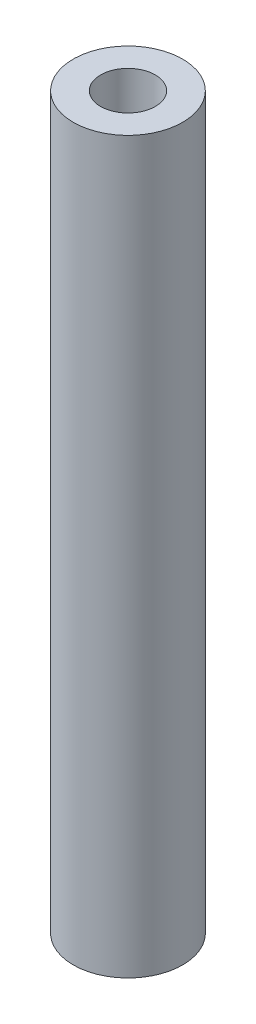
ISO-10303-21;
HEADER;
FILE_DESCRIPTION(('STEP AP214'),'2;1');
FILE_NAME('part.step','',(''),(''),'','','');
FILE_SCHEMA(('AUTOMOTIVE_DESIGN { 1 0 10303 214 1 1 1 1 }'));
ENDSEC;
DATA;
#1=APPLICATION_CONTEXT('core data for automotive mechanical design processes');
#2=APPLICATION_PROTOCOL_DEFINITION('international standard','automotive_design',2000,#1);
#3=PRODUCT_CONTEXT('',#1,'mechanical');
#4=PRODUCT('Part','Part','',(#3));
#5=PRODUCT_RELATED_PRODUCT_CATEGORY('part','',(#4));
#6=PRODUCT_DEFINITION_FORMATION('','',#4);
#7=PRODUCT_DEFINITION_CONTEXT('part definition',#1,'design');
#8=PRODUCT_DEFINITION('design','',#6,#7);
#9=PRODUCT_DEFINITION_SHAPE('','',#8);
#10=(LENGTH_UNIT() NAMED_UNIT(*) SI_UNIT(.MILLI.,.METRE.));
#11=(NAMED_UNIT(*) PLANE_ANGLE_UNIT() SI_UNIT($,.RADIAN.));
#12=(NAMED_UNIT(*) SI_UNIT($,.STERADIAN.) SOLID_ANGLE_UNIT());
#13=UNCERTAINTY_MEASURE_WITH_UNIT(LENGTH_MEASURE(1.E-05),#10,'distance_accuracy_value','');
#14=(GEOMETRIC_REPRESENTATION_CONTEXT(3) GLOBAL_UNCERTAINTY_ASSIGNED_CONTEXT((#13)) GLOBAL_UNIT_ASSIGNED_CONTEXT((#10,
#11,#12)) REPRESENTATION_CONTEXT('',''));
#15=CARTESIAN_POINT('',(0.,0.,0.));
#16=DIRECTION('',(0.,0.,1.));
#17=DIRECTION('',(1.,0.,0.));
#18=AXIS2_PLACEMENT_3D('',#15,#16,#17);
#19=CARTESIAN_POINT('',(0.,80.,0.));
#20=DIRECTION('',(0.,-1.,0.));
#21=DIRECTION('',(0.,0.,-1.));
#22=AXIS2_PLACEMENT_3D('',#19,#20,#21);
#23=CYLINDRICAL_SURFACE('',#22,1.5);
#24=CARTESIAN_POINT('',(0.,0.,0.));
#25=DIRECTION('',(0.,1.,0.));
#26=DIRECTION('',(0.,0.,1.));
#27=AXIS2_PLACEMENT_3D('',#24,#25,#26);
#28=CIRCLE('',#27,1.5);
#29=CARTESIAN_POINT('',(0.,0.,1.5));
#30=VERTEX_POINT('',#29);
#31=EDGE_CURVE('E52',#30,#30,#28,.T.);
#32=ORIENTED_EDGE('',*,*,#31,.F.);
#33=EDGE_LOOP('',(#32));
#34=FACE_BOUND('',#33,.T.);
#35=CARTESIAN_POINT('',(0.,75.,0.));
#36=DIRECTION('',(0.,1.,0.));
#37=DIRECTION('',(0.,0.,1.));
#38=AXIS2_PLACEMENT_3D('',#35,#36,#37);
#39=CIRCLE('',#38,1.5);
#40=CARTESIAN_POINT('',(0.,75.,1.5));
#41=VERTEX_POINT('',#40);
#42=EDGE_CURVE('E41',#41,#41,#39,.T.);
#43=ORIENTED_EDGE('',*,*,#42,.T.);
#44=EDGE_LOOP('',(#43));
#45=FACE_BOUND('',#44,.T.);
#46=ADVANCED_FACE('F37',(#34,#45),#23,.F.);
#47=CARTESIAN_POINT('',(0.,80.,0.));
#48=DIRECTION('',(0.,1.,0.));
#49=DIRECTION('',(0.,0.,1.));
#50=AXIS2_PLACEMENT_3D('',#47,#48,#49);
#51=PLANE('',#50);
#52=CARTESIAN_POINT('',(0.,80.,0.));
#53=DIRECTION('',(0.,1.,0.));
#54=DIRECTION('',(0.,0.,1.));
#55=AXIS2_PLACEMENT_3D('',#52,#53,#54);
#56=CIRCLE('',#55,3.);
#57=CARTESIAN_POINT('',(0.,80.,3.));
#58=VERTEX_POINT('',#57);
#59=EDGE_CURVE('E57',#58,#58,#56,.T.);
#60=ORIENTED_EDGE('',*,*,#59,.F.);
#61=EDGE_LOOP('',(#60));
#62=FACE_BOUND('',#61,.T.);
#63=CARTESIAN_POINT('',(0.,80.,0.));
#64=DIRECTION('',(0.,1.,0.));
#65=DIRECTION('',(0.,0.,1.));
#66=AXIS2_PLACEMENT_3D('',#63,#64,#65);
#67=CIRCLE('',#66,6.);
#68=CARTESIAN_POINT('',(0.,80.,6.));
#69=VERTEX_POINT('',#68);
#70=EDGE_CURVE('E10',#69,#69,#67,.T.);
#71=ORIENTED_EDGE('',*,*,#70,.T.);
#72=EDGE_LOOP('',(#71));
#73=FACE_BOUND('',#72,.T.);
#74=ADVANCED_FACE('F81',(#62,#73),#51,.T.);
#75=CARTESIAN_POINT('',(0.,0.,0.));
#76=DIRECTION('',(0.,1.,0.));
#77=DIRECTION('',(0.,0.,1.));
#78=AXIS2_PLACEMENT_3D('',#75,#76,#77);
#79=PLANE('',#78);
#80=CARTESIAN_POINT('',(0.,0.,0.));
#81=DIRECTION('',(0.,1.,0.));
#82=DIRECTION('',(0.,0.,1.));
#83=AXIS2_PLACEMENT_3D('',#80,#81,#82);
#84=CIRCLE('',#83,6.);
#85=CARTESIAN_POINT('',(0.,0.,6.));
#86=VERTEX_POINT('',#85);
#87=EDGE_CURVE('E46',#86,#86,#84,.T.);
#88=ORIENTED_EDGE('',*,*,#87,.F.);
#89=EDGE_LOOP('',(#88));
#90=FACE_BOUND('',#89,.T.);
#91=ORIENTED_EDGE('',*,*,#31,.T.);
#92=EDGE_LOOP('',(#91));
#93=FACE_BOUND('',#92,.T.);
#94=ADVANCED_FACE('F87',(#90,#93),#79,.F.);
#95=CARTESIAN_POINT('',(0.,80.,0.));
#96=DIRECTION('',(0.,-1.,0.));
#97=DIRECTION('',(0.,0.,-1.));
#98=AXIS2_PLACEMENT_3D('',#95,#96,#97);
#99=CYLINDRICAL_SURFACE('',#98,6.);
#100=ORIENTED_EDGE('',*,*,#70,.F.);
#101=EDGE_LOOP('',(#100));
#102=FACE_BOUND('',#101,.T.);
#103=ORIENTED_EDGE('',*,*,#87,.T.);
#104=EDGE_LOOP('',(#103));
#105=FACE_BOUND('',#104,.T.);
#106=ADVANCED_FACE('F39',(#102,#105),#99,.T.);
#107=CARTESIAN_POINT('',(0.,75.,0.));
#108=DIRECTION('',(0.,1.,0.));
#109=DIRECTION('',(0.,0.,1.));
#110=AXIS2_PLACEMENT_3D('',#107,#108,#109);
#111=CYLINDRICAL_SURFACE('',#110,3.);
#112=CARTESIAN_POINT('',(0.,75.,0.));
#113=DIRECTION('',(0.,1.,0.));
#114=DIRECTION('',(0.,0.,1.));
#115=AXIS2_PLACEMENT_3D('',#112,#113,#114);
#116=CIRCLE('',#115,3.);
#117=CARTESIAN_POINT('',(0.,75.,3.));
#118=VERTEX_POINT('',#117);
#119=EDGE_CURVE('E61',#118,#118,#116,.T.);
#120=ORIENTED_EDGE('',*,*,#119,.F.);
#121=EDGE_LOOP('',(#120));
#122=FACE_BOUND('',#121,.T.);
#123=ORIENTED_EDGE('',*,*,#59,.T.);
#124=EDGE_LOOP('',(#123));
#125=FACE_BOUND('',#124,.T.);
#126=ADVANCED_FACE('F73',(#122,#125),#111,.F.);
#127=CARTESIAN_POINT('',(0.,75.,0.));
#128=DIRECTION('',(0.,1.,0.));
#129=DIRECTION('',(0.,0.,1.));
#130=AXIS2_PLACEMENT_3D('',#127,#128,#129);
#131=PLANE('',#130);
#132=ORIENTED_EDGE('',*,*,#42,.F.);
#133=EDGE_LOOP('',(#132));
#134=FACE_BOUND('',#133,.T.);
#135=ORIENTED_EDGE('',*,*,#119,.T.);
#136=EDGE_LOOP('',(#135));
#137=FACE_BOUND('',#136,.T.);
#138=ADVANCED_FACE('F71',(#134,#137),#131,.T.);
#139=CLOSED_SHELL('',(#46,#74,#94,#106,#126,#138));
#140=MANIFOLD_SOLID_BREP('B2',#139);
#141=ADVANCED_BREP_SHAPE_REPRESENTATION('',(#18,#140),#14);
#142=SHAPE_DEFINITION_REPRESENTATION(#9,#141);
ENDSEC;
END-ISO-10303-21;
